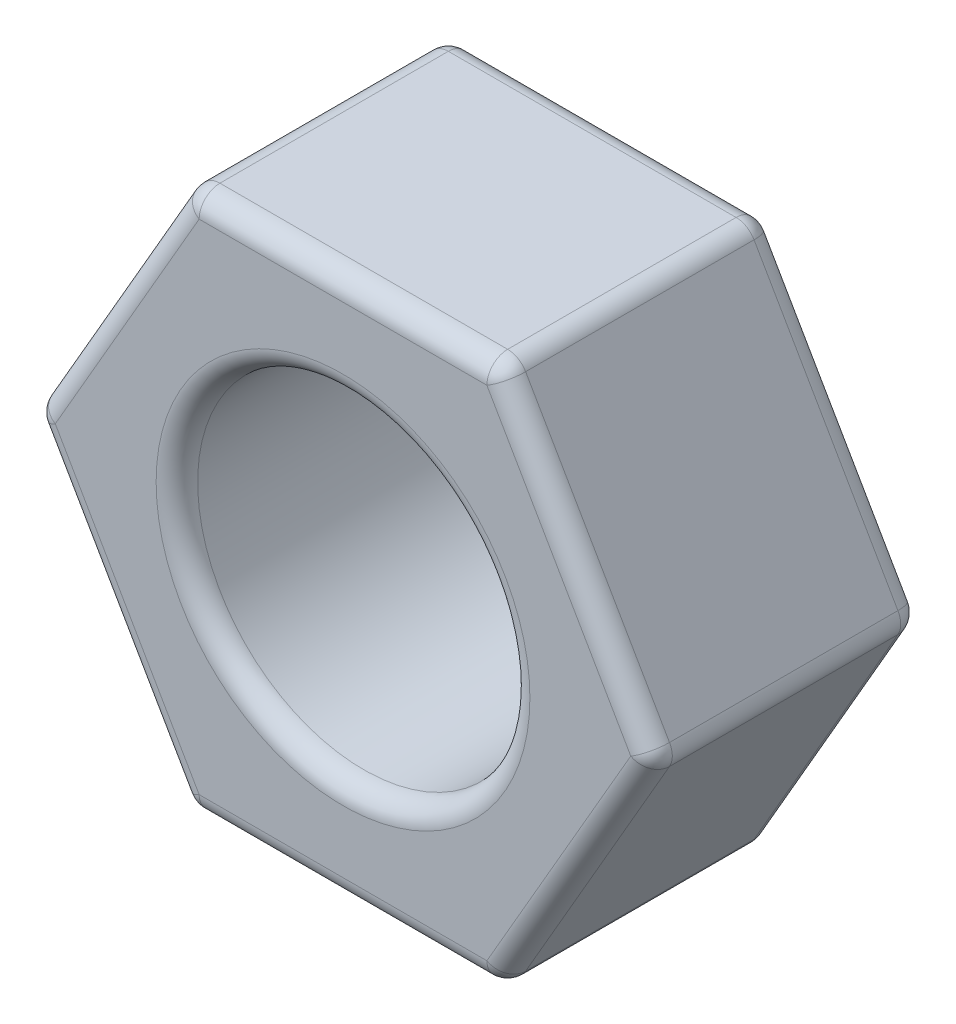
ISO-10303-21;
HEADER;
FILE_DESCRIPTION(('STEP AP214'),'2;1');
FILE_NAME('part.step','',(''),(''),'','','');
FILE_SCHEMA(('AUTOMOTIVE_DESIGN { 1 0 10303 214 1 1 1 1 }'));
ENDSEC;
DATA;
#1=APPLICATION_CONTEXT('core data for automotive mechanical design processes');
#2=APPLICATION_PROTOCOL_DEFINITION('international standard','automotive_design',2000,#1);
#3=PRODUCT_CONTEXT('',#1,'mechanical');
#4=PRODUCT('Part','Part','',(#3));
#5=PRODUCT_RELATED_PRODUCT_CATEGORY('part','',(#4));
#6=PRODUCT_DEFINITION_FORMATION('','',#4);
#7=PRODUCT_DEFINITION_CONTEXT('part definition',#1,'design');
#8=PRODUCT_DEFINITION('design','',#6,#7);
#9=PRODUCT_DEFINITION_SHAPE('','',#8);
#10=(LENGTH_UNIT() NAMED_UNIT(*) SI_UNIT(.MILLI.,.METRE.));
#11=(NAMED_UNIT(*) PLANE_ANGLE_UNIT() SI_UNIT($,.RADIAN.));
#12=(NAMED_UNIT(*) SI_UNIT($,.STERADIAN.) SOLID_ANGLE_UNIT());
#13=UNCERTAINTY_MEASURE_WITH_UNIT(LENGTH_MEASURE(1.E-05),#10,'distance_accuracy_value','');
#14=(GEOMETRIC_REPRESENTATION_CONTEXT(3) GLOBAL_UNCERTAINTY_ASSIGNED_CONTEXT((#13)) GLOBAL_UNIT_ASSIGNED_CONTEXT((#10,
#11,#12)) REPRESENTATION_CONTEXT('',''));
#15=CARTESIAN_POINT('',(0.,0.,0.));
#16=DIRECTION('',(0.,0.,1.));
#17=DIRECTION('',(1.,0.,0.));
#18=AXIS2_PLACEMENT_3D('',#15,#16,#17);
#19=CARTESIAN_POINT('',(-3.75277674973257,6.5,6.5));
#20=DIRECTION('',(0.866025403784439,-0.5,0.));
#21=DIRECTION('',(0.5,0.866025403784439,0.));
#22=AXIS2_PLACEMENT_3D('',#19,#20,#21);
#23=PLANE('',#22);
#24=DIRECTION('',(0.,0.,-1.));
#25=VECTOR('',#24,1.);
#26=CARTESIAN_POINT('',(-3.89711431702997,6.25,6.5));
#27=LINE('',#26,#25);
#28=CARTESIAN_POINT('',(-3.89711431702997,6.25,6.));
#29=VERTEX_POINT('',#28);
#30=CARTESIAN_POINT('',(-3.89711431702997,6.25,0.5));
#31=VERTEX_POINT('',#30);
#32=EDGE_CURVE('E255',#29,#31,#27,.T.);
#33=ORIENTED_EDGE('',*,*,#32,.T.);
#34=DIRECTION('',(-0.5,-0.866025403784439,0.));
#35=VECTOR('',#34,1.);
#36=CARTESIAN_POINT('',(-3.75277674973257,6.5,0.5));
#37=LINE('',#36,#35);
#38=CARTESIAN_POINT('',(-7.36121593216773,0.25,0.5));
#39=VERTEX_POINT('',#38);
#40=EDGE_CURVE('E260',#31,#39,#37,.T.);
#41=ORIENTED_EDGE('',*,*,#40,.T.);
#42=DIRECTION('',(0.,0.,-1.));
#43=VECTOR('',#42,1.);
#44=CARTESIAN_POINT('',(-7.36121593216773,0.249999999999999,6.5));
#45=LINE('',#44,#43);
#46=CARTESIAN_POINT('',(-7.36121593216773,0.25,6.));
#47=VERTEX_POINT('',#46);
#48=EDGE_CURVE('E257',#39,#47,#45,.F.);
#49=ORIENTED_EDGE('',*,*,#48,.T.);
#50=DIRECTION('',(-0.5,-0.866025403784439,0.));
#51=VECTOR('',#50,1.);
#52=CARTESIAN_POINT('',(-3.75277674973257,6.5,6.));
#53=LINE('',#52,#51);
#54=EDGE_CURVE('E253',#47,#29,#53,.F.);
#55=ORIENTED_EDGE('',*,*,#54,.T.);
#56=EDGE_LOOP('',(#33,#41,#49,#55));
#57=FACE_BOUND('',#56,.T.);
#58=ADVANCED_FACE('F35',(#57),#23,.F.);
#59=CARTESIAN_POINT('',(-7.50555349946513,0.,6.5));
#60=DIRECTION('',(0.866025403784439,0.5,0.));
#61=DIRECTION('',(-0.5,0.866025403784439,0.));
#62=AXIS2_PLACEMENT_3D('',#59,#60,#61);
#63=PLANE('',#62);
#64=DIRECTION('',(0.,0.,-1.));
#65=VECTOR('',#64,1.);
#66=CARTESIAN_POINT('',(-7.36121593216773,-0.250000000000001,6.5));
#67=LINE('',#66,#65);
#68=CARTESIAN_POINT('',(-7.36121593216773,-0.250000000000001,6.));
#69=VERTEX_POINT('',#68);
#70=CARTESIAN_POINT('',(-7.36121593216773,-0.250000000000001,0.5));
#71=VERTEX_POINT('',#70);
#72=EDGE_CURVE('E229',#69,#71,#67,.T.);
#73=ORIENTED_EDGE('',*,*,#72,.T.);
#74=DIRECTION('',(0.5,-0.866025403784439,0.));
#75=VECTOR('',#74,1.);
#76=CARTESIAN_POINT('',(-7.50555349946513,0.,0.5));
#77=LINE('',#76,#75);
#78=CARTESIAN_POINT('',(-3.89711431702997,-6.25,0.5));
#79=VERTEX_POINT('',#78);
#80=EDGE_CURVE('E234',#71,#79,#77,.T.);
#81=ORIENTED_EDGE('',*,*,#80,.T.);
#82=DIRECTION('',(0.,0.,-1.));
#83=VECTOR('',#82,1.);
#84=CARTESIAN_POINT('',(-3.89711431702997,-6.25,6.5));
#85=LINE('',#84,#83);
#86=CARTESIAN_POINT('',(-3.89711431702997,-6.25,6.));
#87=VERTEX_POINT('',#86);
#88=EDGE_CURVE('E231',#79,#87,#85,.F.);
#89=ORIENTED_EDGE('',*,*,#88,.T.);
#90=DIRECTION('',(0.5,-0.866025403784439,0.));
#91=VECTOR('',#90,1.);
#92=CARTESIAN_POINT('',(-7.50555349946513,0.,6.));
#93=LINE('',#92,#91);
#94=EDGE_CURVE('E227',#87,#69,#93,.F.);
#95=ORIENTED_EDGE('',*,*,#94,.T.);
#96=EDGE_LOOP('',(#73,#81,#89,#95));
#97=FACE_BOUND('',#96,.T.);
#98=ADVANCED_FACE('F418',(#97),#63,.F.);
#99=CARTESIAN_POINT('',(-3.75277674973257,-6.5,6.5));
#100=DIRECTION('',(0.,1.,0.));
#101=DIRECTION('',(0.,0.,1.));
#102=AXIS2_PLACEMENT_3D('',#99,#100,#101);
#103=PLANE('',#102);
#104=DIRECTION('',(0.,0.,-1.));
#105=VECTOR('',#104,1.);
#106=CARTESIAN_POINT('',(-3.46410161513775,-6.5,6.5));
#107=LINE('',#106,#105);
#108=CARTESIAN_POINT('',(-3.46410161513775,-6.5,6.));
#109=VERTEX_POINT('',#108);
#110=CARTESIAN_POINT('',(-3.46410161513775,-6.5,0.5));
#111=VERTEX_POINT('',#110);
#112=EDGE_CURVE('E222',#109,#111,#107,.T.);
#113=ORIENTED_EDGE('',*,*,#112,.T.);
#114=DIRECTION('',(1.,0.,0.));
#115=VECTOR('',#114,1.);
#116=CARTESIAN_POINT('',(-3.75277674973257,-6.5,0.5));
#117=LINE('',#116,#115);
#118=CARTESIAN_POINT('',(3.46410161513775,-6.5,0.5));
#119=VERTEX_POINT('',#118);
#120=EDGE_CURVE('E225',#111,#119,#117,.T.);
#121=ORIENTED_EDGE('',*,*,#120,.T.);
#122=DIRECTION('',(0.,0.,-1.));
#123=VECTOR('',#122,1.);
#124=CARTESIAN_POINT('',(3.46410161513775,-6.5,6.5));
#125=LINE('',#124,#123);
#126=CARTESIAN_POINT('',(3.46410161513775,-6.5,6.));
#127=VERTEX_POINT('',#126);
#128=EDGE_CURVE('E220',#119,#127,#125,.F.);
#129=ORIENTED_EDGE('',*,*,#128,.T.);
#130=DIRECTION('',(1.,0.,0.));
#131=VECTOR('',#130,1.);
#132=CARTESIAN_POINT('',(-3.75277674973257,-6.5,6.));
#133=LINE('',#132,#131);
#134=EDGE_CURVE('E218',#127,#109,#133,.F.);
#135=ORIENTED_EDGE('',*,*,#134,.T.);
#136=EDGE_LOOP('',(#113,#121,#129,#135));
#137=FACE_BOUND('',#136,.T.);
#138=ADVANCED_FACE('F384',(#137),#103,.F.);
#139=CARTESIAN_POINT('',(3.75277674973257,-6.5,6.5));
#140=DIRECTION('',(-0.866025403784439,0.5,0.));
#141=DIRECTION('',(-0.5,-0.866025403784439,0.));
#142=AXIS2_PLACEMENT_3D('',#139,#140,#141);
#143=PLANE('',#142);
#144=DIRECTION('',(0.,0.,-1.));
#145=VECTOR('',#144,1.);
#146=CARTESIAN_POINT('',(3.89711431702997,-6.25,6.5));
#147=LINE('',#146,#145);
#148=CARTESIAN_POINT('',(3.89711431702997,-6.25,6.));
#149=VERTEX_POINT('',#148);
#150=CARTESIAN_POINT('',(3.89711431702997,-6.25,0.5));
#151=VERTEX_POINT('',#150);
#152=EDGE_CURVE('E240',#149,#151,#147,.T.);
#153=ORIENTED_EDGE('',*,*,#152,.T.);
#154=DIRECTION('',(0.5,0.866025403784439,0.));
#155=VECTOR('',#154,1.);
#156=CARTESIAN_POINT('',(3.75277674973257,-6.5,0.5));
#157=LINE('',#156,#155);
#158=CARTESIAN_POINT('',(7.36121593216773,-0.249999999999998,0.5));
#159=VERTEX_POINT('',#158);
#160=EDGE_CURVE('E243',#151,#159,#157,.T.);
#161=ORIENTED_EDGE('',*,*,#160,.T.);
#162=DIRECTION('',(0.,0.,-1.));
#163=VECTOR('',#162,1.);
#164=CARTESIAN_POINT('',(7.36121593216773,-0.249999999999997,6.5));
#165=LINE('',#164,#163);
#166=CARTESIAN_POINT('',(7.36121593216773,-0.249999999999998,6.));
#167=VERTEX_POINT('',#166);
#168=EDGE_CURVE('E238',#159,#167,#165,.F.);
#169=ORIENTED_EDGE('',*,*,#168,.T.);
#170=DIRECTION('',(0.5,0.866025403784439,0.));
#171=VECTOR('',#170,1.);
#172=CARTESIAN_POINT('',(3.75277674973257,-6.5,6.));
#173=LINE('',#172,#171);
#174=EDGE_CURVE('E236',#167,#149,#173,.F.);
#175=ORIENTED_EDGE('',*,*,#174,.T.);
#176=EDGE_LOOP('',(#153,#161,#169,#175));
#177=FACE_BOUND('',#176,.T.);
#178=ADVANCED_FACE('F394',(#177),#143,.F.);
#179=CARTESIAN_POINT('',(7.50555349946513,0.,6.5));
#180=DIRECTION('',(-0.866025403784438,-0.5,0.));
#181=DIRECTION('',(0.5,-0.866025403784439,0.));
#182=AXIS2_PLACEMENT_3D('',#179,#180,#181);
#183=PLANE('',#182);
#184=DIRECTION('',(0.,0.,-1.));
#185=VECTOR('',#184,1.);
#186=CARTESIAN_POINT('',(7.36121593216773,0.250000000000002,6.5));
#187=LINE('',#186,#185);
#188=CARTESIAN_POINT('',(7.36121593216773,0.250000000000002,6.));
#189=VERTEX_POINT('',#188);
#190=CARTESIAN_POINT('',(7.36121593216773,0.250000000000002,0.5));
#191=VERTEX_POINT('',#190);
#192=EDGE_CURVE('E248',#189,#191,#187,.T.);
#193=ORIENTED_EDGE('',*,*,#192,.T.);
#194=DIRECTION('',(-0.5,0.866025403784439,0.));
#195=VECTOR('',#194,1.);
#196=CARTESIAN_POINT('',(7.50555349946513,0.,0.5));
#197=LINE('',#196,#195);
#198=CARTESIAN_POINT('',(3.89711431702997,6.25,0.5));
#199=VERTEX_POINT('',#198);
#200=EDGE_CURVE('E251',#191,#199,#197,.T.);
#201=ORIENTED_EDGE('',*,*,#200,.T.);
#202=DIRECTION('',(0.,0.,-1.));
#203=VECTOR('',#202,1.);
#204=CARTESIAN_POINT('',(3.89711431702997,6.25,6.5));
#205=LINE('',#204,#203);
#206=CARTESIAN_POINT('',(3.89711431702997,6.25,6.));
#207=VERTEX_POINT('',#206);
#208=EDGE_CURVE('E246',#199,#207,#205,.F.);
#209=ORIENTED_EDGE('',*,*,#208,.T.);
#210=DIRECTION('',(-0.5,0.866025403784439,0.));
#211=VECTOR('',#210,1.);
#212=CARTESIAN_POINT('',(7.50555349946513,0.,6.));
#213=LINE('',#212,#211);
#214=EDGE_CURVE('E188',#207,#189,#213,.F.);
#215=ORIENTED_EDGE('',*,*,#214,.T.);
#216=EDGE_LOOP('',(#193,#201,#209,#215));
#217=FACE_BOUND('',#216,.T.);
#218=ADVANCED_FACE('F542',(#217),#183,.F.);
#219=CARTESIAN_POINT('',(3.75277674973257,6.5,6.5));
#220=DIRECTION('',(0.,-1.,0.));
#221=DIRECTION('',(0.,0.,-1.));
#222=AXIS2_PLACEMENT_3D('',#219,#220,#221);
#223=PLANE('',#222);
#224=DIRECTION('',(0.,0.,-1.));
#225=VECTOR('',#224,1.);
#226=CARTESIAN_POINT('',(3.46410161513775,6.5,6.5));
#227=LINE('',#226,#225);
#228=CARTESIAN_POINT('',(3.46410161513775,6.5,6.));
#229=VERTEX_POINT('',#228);
#230=CARTESIAN_POINT('',(3.46410161513775,6.5,0.5));
#231=VERTEX_POINT('',#230);
#232=EDGE_CURVE('E55',#229,#231,#227,.T.);
#233=ORIENTED_EDGE('',*,*,#232,.T.);
#234=DIRECTION('',(-1.,0.,0.));
#235=VECTOR('',#234,1.);
#236=CARTESIAN_POINT('',(3.75277674973257,6.5,0.5));
#237=LINE('',#236,#235);
#238=CARTESIAN_POINT('',(-3.46410161513775,6.5,0.5));
#239=VERTEX_POINT('',#238);
#240=EDGE_CURVE('E11',#231,#239,#237,.T.);
#241=ORIENTED_EDGE('',*,*,#240,.T.);
#242=DIRECTION('',(0.,0.,-1.));
#243=VECTOR('',#242,1.);
#244=CARTESIAN_POINT('',(-3.46410161513775,6.5,6.5));
#245=LINE('',#244,#243);
#246=CARTESIAN_POINT('',(-3.46410161513775,6.5,6.));
#247=VERTEX_POINT('',#246);
#248=EDGE_CURVE('E44',#239,#247,#245,.F.);
#249=ORIENTED_EDGE('',*,*,#248,.T.);
#250=DIRECTION('',(-1.,0.,0.));
#251=VECTOR('',#250,1.);
#252=CARTESIAN_POINT('',(3.75277674973257,6.5,6.));
#253=LINE('',#252,#251);
#254=EDGE_CURVE('E262',#247,#229,#253,.F.);
#255=ORIENTED_EDGE('',*,*,#254,.T.);
#256=EDGE_LOOP('',(#233,#241,#249,#255));
#257=FACE_BOUND('',#256,.T.);
#258=ADVANCED_FACE('F763',(#257),#223,.F.);
#259=CARTESIAN_POINT('',(0.,0.,6.5));
#260=DIRECTION('',(0.,0.,1.));
#261=DIRECTION('',(1.,0.,0.));
#262=AXIS2_PLACEMENT_3D('',#259,#260,#261);
#263=PLANE('',#262);
#264=CARTESIAN_POINT('',(0.,0.,6.5));
#265=DIRECTION('',(0.,0.,1.));
#266=DIRECTION('',(1.,0.,0.));
#267=AXIS2_PLACEMENT_3D('',#264,#265,#266);
#268=CIRCLE('',#267,4.5);
#269=CARTESIAN_POINT('',(4.5,0.,6.5));
#270=VERTEX_POINT('',#269);
#271=EDGE_CURVE('E194',#270,#270,#268,.F.);
#272=ORIENTED_EDGE('',*,*,#271,.T.);
#273=EDGE_LOOP('',(#272));
#274=FACE_BOUND('',#273,.T.);
#275=DIRECTION('',(0.5,0.866025403784439,0.));
#276=VECTOR('',#275,1.);
#277=CARTESIAN_POINT('',(7.07254079757291,0.250000000000002,6.5));
#278=LINE('',#277,#276);
#279=CARTESIAN_POINT('',(3.46410161513776,-6.,6.5));
#280=VERTEX_POINT('',#279);
#281=CARTESIAN_POINT('',(6.92820323027551,0.,6.5));
#282=VERTEX_POINT('',#281);
#283=EDGE_CURVE('E193',#280,#282,#278,.T.);
#284=ORIENTED_EDGE('',*,*,#283,.T.);
#285=DIRECTION('',(-0.5,0.866025403784439,0.));
#286=VECTOR('',#285,1.);
#287=CARTESIAN_POINT('',(3.31976404784034,6.25,6.5));
#288=LINE('',#287,#286);
#289=CARTESIAN_POINT('',(3.46410161513775,6.,6.5));
#290=VERTEX_POINT('',#289);
#291=EDGE_CURVE('E186',#282,#290,#288,.T.);
#292=ORIENTED_EDGE('',*,*,#291,.T.);
#293=DIRECTION('',(-1.,0.,0.));
#294=VECTOR('',#293,1.);
#295=CARTESIAN_POINT('',(-3.75277674973257,6.,6.5));
#296=LINE('',#295,#294);
#297=CARTESIAN_POINT('',(-3.46410161513775,6.,6.5));
#298=VERTEX_POINT('',#297);
#299=EDGE_CURVE('E160',#290,#298,#296,.T.);
#300=ORIENTED_EDGE('',*,*,#299,.T.);
#301=DIRECTION('',(-0.5,-0.866025403784439,0.));
#302=VECTOR('',#301,1.);
#303=CARTESIAN_POINT('',(-7.07254079757292,-0.250000000000001,6.5));
#304=LINE('',#303,#302);
#305=CARTESIAN_POINT('',(-6.92820323027551,0.,6.5));
#306=VERTEX_POINT('',#305);
#307=EDGE_CURVE('E169',#298,#306,#304,.T.);
#308=ORIENTED_EDGE('',*,*,#307,.T.);
#309=DIRECTION('',(0.5,-0.866025403784439,0.));
#310=VECTOR('',#309,1.);
#311=CARTESIAN_POINT('',(-3.31976404784035,-6.25,6.5));
#312=LINE('',#311,#310);
#313=CARTESIAN_POINT('',(-3.46410161513775,-6.,6.5));
#314=VERTEX_POINT('',#313);
#315=EDGE_CURVE('E365',#306,#314,#312,.T.);
#316=ORIENTED_EDGE('',*,*,#315,.T.);
#317=DIRECTION('',(1.,0.,0.));
#318=VECTOR('',#317,1.);
#319=CARTESIAN_POINT('',(3.75277674973257,-6.,6.5));
#320=LINE('',#319,#318);
#321=EDGE_CURVE('E199',#314,#280,#320,.T.);
#322=ORIENTED_EDGE('',*,*,#321,.T.);
#323=EDGE_LOOP('',(#284,#292,#300,#308,#316,#322));
#324=FACE_BOUND('',#323,.T.);
#325=ADVANCED_FACE('F191',(#274,#324),#263,.T.);
#326=CARTESIAN_POINT('',(0.,0.,0.));
#327=DIRECTION('',(0.,0.,1.));
#328=DIRECTION('',(1.,0.,0.));
#329=AXIS2_PLACEMENT_3D('',#326,#327,#328);
#330=PLANE('',#329);
#331=CARTESIAN_POINT('',(0.,0.,0.));
#332=DIRECTION('',(0.,0.,1.));
#333=DIRECTION('',(1.,0.,0.));
#334=AXIS2_PLACEMENT_3D('',#331,#332,#333);
#335=CIRCLE('',#334,4.5);
#336=CARTESIAN_POINT('',(4.5,0.,0.));
#337=VERTEX_POINT('',#336);
#338=EDGE_CURVE('E215',#337,#337,#335,.T.);
#339=ORIENTED_EDGE('',*,*,#338,.T.);
#340=EDGE_LOOP('',(#339));
#341=FACE_BOUND('',#340,.T.);
#342=DIRECTION('',(-1.,0.,0.));
#343=VECTOR('',#342,1.);
#344=CARTESIAN_POINT('',(0.,6.,0.));
#345=LINE('',#344,#343);
#346=CARTESIAN_POINT('',(-3.46410161513775,6.,0.));
#347=VERTEX_POINT('',#346);
#348=CARTESIAN_POINT('',(3.46410161513775,6.,0.));
#349=VERTEX_POINT('',#348);
#350=EDGE_CURVE('E197',#347,#349,#345,.F.);
#351=ORIENTED_EDGE('',*,*,#350,.T.);
#352=DIRECTION('',(-0.5,0.866025403784439,0.));
#353=VECTOR('',#352,1.);
#354=CARTESIAN_POINT('',(5.19615242270663,3.,0.));
#355=LINE('',#354,#353);
#356=CARTESIAN_POINT('',(6.92820323027551,0.,0.));
#357=VERTEX_POINT('',#356);
#358=EDGE_CURVE('E212',#349,#357,#355,.F.);
#359=ORIENTED_EDGE('',*,*,#358,.T.);
#360=DIRECTION('',(0.5,0.866025403784439,0.));
#361=VECTOR('',#360,1.);
#362=CARTESIAN_POINT('',(5.19615242270663,-3.,0.));
#363=LINE('',#362,#361);
#364=CARTESIAN_POINT('',(3.46410161513775,-6.,0.));
#365=VERTEX_POINT('',#364);
#366=EDGE_CURVE('E210',#357,#365,#363,.F.);
#367=ORIENTED_EDGE('',*,*,#366,.T.);
#368=DIRECTION('',(1.,0.,0.));
#369=VECTOR('',#368,1.);
#370=CARTESIAN_POINT('',(0.,-6.,0.));
#371=LINE('',#370,#369);
#372=CARTESIAN_POINT('',(-3.46410161513775,-6.,0.));
#373=VERTEX_POINT('',#372);
#374=EDGE_CURVE('E208',#365,#373,#371,.F.);
#375=ORIENTED_EDGE('',*,*,#374,.T.);
#376=DIRECTION('',(0.5,-0.866025403784439,0.));
#377=VECTOR('',#376,1.);
#378=CARTESIAN_POINT('',(-5.19615242270663,-3.,0.));
#379=LINE('',#378,#377);
#380=CARTESIAN_POINT('',(-6.92820323027551,0.,0.));
#381=VERTEX_POINT('',#380);
#382=EDGE_CURVE('E206',#373,#381,#379,.F.);
#383=ORIENTED_EDGE('',*,*,#382,.T.);
#384=DIRECTION('',(-0.5,-0.866025403784439,0.));
#385=VECTOR('',#384,1.);
#386=CARTESIAN_POINT('',(-5.19615242270663,3.,0.));
#387=LINE('',#386,#385);
#388=EDGE_CURVE('E204',#381,#347,#387,.F.);
#389=ORIENTED_EDGE('',*,*,#388,.T.);
#390=EDGE_LOOP('',(#351,#359,#367,#375,#383,#389));
#391=FACE_BOUND('',#390,.T.);
#392=ADVANCED_FACE('F512',(#341,#391),#330,.F.);
#393=CARTESIAN_POINT('',(0.,0.,6.5));
#394=DIRECTION('',(0.,0.,1.));
#395=DIRECTION('',(1.,0.,0.));
#396=AXIS2_PLACEMENT_3D('',#393,#394,#395);
#397=CYLINDRICAL_SURFACE('',#396,4.);
#398=CARTESIAN_POINT('',(0.,0.,6.));
#399=DIRECTION('',(0.,0.,1.));
#400=DIRECTION('',(1.,0.,0.));
#401=AXIS2_PLACEMENT_3D('',#398,#399,#400);
#402=CIRCLE('',#401,4.);
#403=CARTESIAN_POINT('',(4.,0.,6.));
#404=VERTEX_POINT('',#403);
#405=EDGE_CURVE('E170',#404,#404,#402,.T.);
#406=ORIENTED_EDGE('',*,*,#405,.T.);
#407=EDGE_LOOP('',(#406));
#408=FACE_BOUND('',#407,.T.);
#409=CARTESIAN_POINT('',(0.,0.,0.5));
#410=DIRECTION('',(0.,0.,1.));
#411=DIRECTION('',(1.,0.,0.));
#412=AXIS2_PLACEMENT_3D('',#409,#410,#411);
#413=CIRCLE('',#412,4.);
#414=CARTESIAN_POINT('',(4.,0.,0.5));
#415=VERTEX_POINT('',#414);
#416=EDGE_CURVE('E356',#415,#415,#413,.F.);
#417=ORIENTED_EDGE('',*,*,#416,.T.);
#418=EDGE_LOOP('',(#417));
#419=FACE_BOUND('',#418,.T.);
#420=ADVANCED_FACE('F432',(#408,#419),#397,.F.);
#421=CARTESIAN_POINT('',(0.,0.,6.));
#422=DIRECTION('',(0.,0.,1.));
#423=DIRECTION('',(1.,0.,0.));
#424=AXIS2_PLACEMENT_3D('',#421,#422,#423);
#425=TOROIDAL_SURFACE('',#424,4.5,0.5);
#426=ORIENTED_EDGE('',*,*,#271,.F.);
#427=EDGE_LOOP('',(#426));
#428=FACE_BOUND('',#427,.T.);
#429=ORIENTED_EDGE('',*,*,#405,.F.);
#430=EDGE_LOOP('',(#429));
#431=FACE_BOUND('',#430,.T.);
#432=ADVANCED_FACE('F428',(#428,#431),#425,.T.);
#433=CARTESIAN_POINT('',(0.,0.,0.5));
#434=DIRECTION('',(0.,0.,1.));
#435=DIRECTION('',(1.,0.,0.));
#436=AXIS2_PLACEMENT_3D('',#433,#434,#435);
#437=TOROIDAL_SURFACE('',#436,4.5,0.5);
#438=ORIENTED_EDGE('',*,*,#416,.F.);
#439=EDGE_LOOP('',(#438));
#440=FACE_BOUND('',#439,.T.);
#441=ORIENTED_EDGE('',*,*,#338,.F.);
#442=EDGE_LOOP('',(#441));
#443=FACE_BOUND('',#442,.T.);
#444=ADVANCED_FACE('F431',(#440,#443),#437,.T.);
#445=CARTESIAN_POINT('',(3.46410161513775,6.,6.5));
#446=DIRECTION('',(0.,0.,-1.));
#447=DIRECTION('',(-1.,0.,0.));
#448=AXIS2_PLACEMENT_3D('',#445,#446,#447);
#449=CYLINDRICAL_SURFACE('',#448,0.5);
#450=CARTESIAN_POINT('',(3.46410161513775,6.,6.));
#451=DIRECTION('',(0.,0.,1.));
#452=DIRECTION('',(1.,0.,0.));
#453=AXIS2_PLACEMENT_3D('',#450,#451,#452);
#454=CIRCLE('',#453,0.5);
#455=EDGE_CURVE('E39',#207,#229,#454,.T.);
#456=ORIENTED_EDGE('',*,*,#455,.F.);
#457=ORIENTED_EDGE('',*,*,#208,.F.);
#458=CARTESIAN_POINT('',(3.46410161513775,6.,0.5));
#459=DIRECTION('',(0.,0.,-1.));
#460=DIRECTION('',(-1.,0.,0.));
#461=AXIS2_PLACEMENT_3D('',#458,#459,#460);
#462=CIRCLE('',#461,0.5);
#463=EDGE_CURVE('E180',#231,#199,#462,.T.);
#464=ORIENTED_EDGE('',*,*,#463,.F.);
#465=ORIENTED_EDGE('',*,*,#232,.F.);
#466=EDGE_LOOP('',(#456,#457,#464,#465));
#467=FACE_BOUND('',#466,.T.);
#468=ADVANCED_FACE('F37',(#467),#449,.T.);
#469=CARTESIAN_POINT('',(3.46410161513775,6.,6.));
#470=DIRECTION('',(0.,0.,1.));
#471=DIRECTION('',(1.,0.,0.));
#472=AXIS2_PLACEMENT_3D('',#469,#470,#471);
#473=SPHERICAL_SURFACE('',#472,0.5);
#474=CARTESIAN_POINT('',(3.46410161513775,6.,6.));
#475=DIRECTION('',(-0.499999999999999,0.86602540378444,0.));
#476=DIRECTION('',(-0.86602540378444,-0.499999999999999,0.));
#477=AXIS2_PLACEMENT_3D('',#474,#475,#476);
#478=CIRCLE('',#477,0.5);
#479=EDGE_CURVE('E177',#207,#290,#478,.F.);
#480=ORIENTED_EDGE('',*,*,#479,.F.);
#481=ORIENTED_EDGE('',*,*,#455,.T.);
#482=CARTESIAN_POINT('',(3.46410161513775,6.,6.));
#483=DIRECTION('',(1.,0.,0.));
#484=DIRECTION('',(0.,0.,-1.));
#485=AXIS2_PLACEMENT_3D('',#482,#483,#484);
#486=CIRCLE('',#485,0.5);
#487=EDGE_CURVE('E164',#290,#229,#486,.F.);
#488=ORIENTED_EDGE('',*,*,#487,.F.);
#489=EDGE_LOOP('',(#480,#481,#488));
#490=FACE_BOUND('',#489,.T.);
#491=ADVANCED_FACE('F176',(#490),#473,.T.);
#492=CARTESIAN_POINT('',(3.46410161513775,6.,0.5));
#493=DIRECTION('',(0.,0.,1.));
#494=DIRECTION('',(1.,0.,0.));
#495=AXIS2_PLACEMENT_3D('',#492,#493,#494);
#496=SPHERICAL_SURFACE('',#495,0.5);
#497=CARTESIAN_POINT('',(3.46410161513775,6.,0.5));
#498=DIRECTION('',(1.,0.,0.));
#499=DIRECTION('',(0.,1.,0.));
#500=AXIS2_PLACEMENT_3D('',#497,#498,#499);
#501=CIRCLE('',#500,0.5);
#502=EDGE_CURVE('E348',#231,#349,#501,.F.);
#503=ORIENTED_EDGE('',*,*,#502,.F.);
#504=ORIENTED_EDGE('',*,*,#463,.T.);
#505=CARTESIAN_POINT('',(3.46410161513775,6.,0.5));
#506=DIRECTION('',(-0.5,0.866025403784438,0.));
#507=DIRECTION('',(-0.866025403784438,-0.5,0.));
#508=AXIS2_PLACEMENT_3D('',#505,#506,#507);
#509=CIRCLE('',#508,0.5);
#510=EDGE_CURVE('E189',#349,#199,#509,.F.);
#511=ORIENTED_EDGE('',*,*,#510,.F.);
#512=EDGE_LOOP('',(#503,#504,#511));
#513=FACE_BOUND('',#512,.T.);
#514=ADVANCED_FACE('F544',(#513),#496,.T.);
#515=CARTESIAN_POINT('',(0.,6.,6.));
#516=DIRECTION('',(1.,0.,0.));
#517=DIRECTION('',(0.,0.,-1.));
#518=AXIS2_PLACEMENT_3D('',#515,#516,#517);
#519=CYLINDRICAL_SURFACE('',#518,0.5);
#520=ORIENTED_EDGE('',*,*,#487,.T.);
#521=ORIENTED_EDGE('',*,*,#254,.F.);
#522=CARTESIAN_POINT('',(-3.46410161513775,6.,6.));
#523=DIRECTION('',(-1.,0.,0.));
#524=DIRECTION('',(0.,-1.,0.));
#525=AXIS2_PLACEMENT_3D('',#522,#523,#524);
#526=CIRCLE('',#525,0.5);
#527=EDGE_CURVE('E165',#298,#247,#526,.T.);
#528=ORIENTED_EDGE('',*,*,#527,.F.);
#529=ORIENTED_EDGE('',*,*,#299,.F.);
#530=EDGE_LOOP('',(#520,#521,#528,#529));
#531=FACE_BOUND('',#530,.T.);
#532=ADVANCED_FACE('F162',(#531),#519,.T.);
#533=CARTESIAN_POINT('',(5.19615242270663,3.,6.));
#534=DIRECTION('',(0.5,-0.866025403784439,0.));
#535=DIRECTION('',(0.866025403784438,0.5,0.));
#536=AXIS2_PLACEMENT_3D('',#533,#534,#535);
#537=CYLINDRICAL_SURFACE('',#536,0.5);
#538=ORIENTED_EDGE('',*,*,#479,.T.);
#539=ORIENTED_EDGE('',*,*,#291,.F.);
#540=CARTESIAN_POINT('',(6.92820323027551,0.,6.));
#541=DIRECTION('',(0.5,-0.866025403784439,0.));
#542=DIRECTION('',(0.866025403784439,0.5,0.));
#543=AXIS2_PLACEMENT_3D('',#540,#541,#542);
#544=CIRCLE('',#543,0.5);
#545=EDGE_CURVE('E342',#189,#282,#544,.T.);
#546=ORIENTED_EDGE('',*,*,#545,.F.);
#547=ORIENTED_EDGE('',*,*,#214,.F.);
#548=EDGE_LOOP('',(#538,#539,#546,#547));
#549=FACE_BOUND('',#548,.T.);
#550=ADVANCED_FACE('F184',(#549),#537,.T.);
#551=CARTESIAN_POINT('',(6.92820323027551,0.,6.5));
#552=DIRECTION('',(0.,0.,-1.));
#553=DIRECTION('',(-1.,0.,0.));
#554=AXIS2_PLACEMENT_3D('',#551,#552,#553);
#555=CYLINDRICAL_SURFACE('',#554,0.5);
#556=CARTESIAN_POINT('',(6.92820323027551,0.,0.5));
#557=DIRECTION('',(0.,0.,-1.));
#558=DIRECTION('',(-1.,0.,0.));
#559=AXIS2_PLACEMENT_3D('',#556,#557,#558);
#560=CIRCLE('',#559,0.5);
#561=EDGE_CURVE('E336',#191,#159,#560,.T.);
#562=ORIENTED_EDGE('',*,*,#561,.F.);
#563=ORIENTED_EDGE('',*,*,#192,.F.);
#564=CARTESIAN_POINT('',(6.92820323027551,0.,6.));
#565=DIRECTION('',(0.,0.,1.));
#566=DIRECTION('',(1.,0.,0.));
#567=AXIS2_PLACEMENT_3D('',#564,#565,#566);
#568=CIRCLE('',#567,0.5);
#569=EDGE_CURVE('E339',#167,#189,#568,.T.);
#570=ORIENTED_EDGE('',*,*,#569,.F.);
#571=ORIENTED_EDGE('',*,*,#168,.F.);
#572=EDGE_LOOP('',(#562,#563,#570,#571));
#573=FACE_BOUND('',#572,.T.);
#574=ADVANCED_FACE('F400',(#573),#555,.T.);
#575=CARTESIAN_POINT('',(7.07254079757291,-0.249999999999998,0.5));
#576=DIRECTION('',(-0.5,0.866025403784439,0.));
#577=DIRECTION('',(-0.866025403784438,-0.5,0.));
#578=AXIS2_PLACEMENT_3D('',#575,#576,#577);
#579=CYLINDRICAL_SURFACE('',#578,0.5);
#580=ORIENTED_EDGE('',*,*,#510,.T.);
#581=ORIENTED_EDGE('',*,*,#200,.F.);
#582=CARTESIAN_POINT('',(6.92820323027551,0.,0.5));
#583=DIRECTION('',(0.5,-0.866025403784439,0.));
#584=DIRECTION('',(0.866025403784439,0.5,0.));
#585=AXIS2_PLACEMENT_3D('',#582,#583,#584);
#586=CIRCLE('',#585,0.5);
#587=EDGE_CURVE('E334',#357,#191,#586,.T.);
#588=ORIENTED_EDGE('',*,*,#587,.F.);
#589=ORIENTED_EDGE('',*,*,#358,.F.);
#590=EDGE_LOOP('',(#580,#581,#588,#589));
#591=FACE_BOUND('',#590,.T.);
#592=ADVANCED_FACE('F539',(#591),#579,.T.);
#593=CARTESIAN_POINT('',(3.75277674973257,6.,0.5));
#594=DIRECTION('',(-1.,0.,0.));
#595=DIRECTION('',(0.,0.,1.));
#596=AXIS2_PLACEMENT_3D('',#593,#594,#595);
#597=CYLINDRICAL_SURFACE('',#596,0.5);
#598=ORIENTED_EDGE('',*,*,#502,.T.);
#599=ORIENTED_EDGE('',*,*,#350,.F.);
#600=CARTESIAN_POINT('',(-3.46410161513775,6.,0.5));
#601=DIRECTION('',(-1.,0.,0.));
#602=DIRECTION('',(0.,0.,1.));
#603=AXIS2_PLACEMENT_3D('',#600,#601,#602);
#604=CIRCLE('',#603,0.5);
#605=EDGE_CURVE('E331',#239,#347,#604,.T.);
#606=ORIENTED_EDGE('',*,*,#605,.F.);
#607=ORIENTED_EDGE('',*,*,#240,.F.);
#608=EDGE_LOOP('',(#598,#599,#606,#607));
#609=FACE_BOUND('',#608,.T.);
#610=ADVANCED_FACE('F510',(#609),#597,.T.);
#611=CARTESIAN_POINT('',(-3.46410161513775,6.,6.5));
#612=DIRECTION('',(0.,0.,-1.));
#613=DIRECTION('',(-1.,0.,0.));
#614=AXIS2_PLACEMENT_3D('',#611,#612,#613);
#615=CYLINDRICAL_SURFACE('',#614,0.5);
#616=CARTESIAN_POINT('',(-3.46410161513775,6.,6.));
#617=DIRECTION('',(0.,0.,1.));
#618=DIRECTION('',(1.,0.,0.));
#619=AXIS2_PLACEMENT_3D('',#616,#617,#618);
#620=CIRCLE('',#619,0.5);
#621=EDGE_CURVE('E345',#247,#29,#620,.T.);
#622=ORIENTED_EDGE('',*,*,#621,.F.);
#623=ORIENTED_EDGE('',*,*,#248,.F.);
#624=CARTESIAN_POINT('',(-3.46410161513775,6.,0.5));
#625=DIRECTION('',(0.,0.,-1.));
#626=DIRECTION('',(-1.,0.,0.));
#627=AXIS2_PLACEMENT_3D('',#624,#625,#626);
#628=CIRCLE('',#627,0.5);
#629=EDGE_CURVE('E328',#31,#239,#628,.T.);
#630=ORIENTED_EDGE('',*,*,#629,.F.);
#631=ORIENTED_EDGE('',*,*,#32,.F.);
#632=EDGE_LOOP('',(#622,#623,#630,#631));
#633=FACE_BOUND('',#632,.T.);
#634=ADVANCED_FACE('F414',(#633),#615,.T.);
#635=CARTESIAN_POINT('',(-3.46410161513775,6.,6.));
#636=DIRECTION('',(0.,0.,1.));
#637=DIRECTION('',(1.,0.,0.));
#638=AXIS2_PLACEMENT_3D('',#635,#636,#637);
#639=SPHERICAL_SURFACE('',#638,0.5);
#640=ORIENTED_EDGE('',*,*,#527,.T.);
#641=ORIENTED_EDGE('',*,*,#621,.T.);
#642=CARTESIAN_POINT('',(-3.46410161513775,6.,6.));
#643=DIRECTION('',(0.5,0.866025403784438,0.));
#644=DIRECTION('',(-0.866025403784438,0.5,0.));
#645=AXIS2_PLACEMENT_3D('',#642,#643,#644);
#646=CIRCLE('',#645,0.5);
#647=EDGE_CURVE('E325',#298,#29,#646,.F.);
#648=ORIENTED_EDGE('',*,*,#647,.F.);
#649=EDGE_LOOP('',(#640,#641,#648));
#650=FACE_BOUND('',#649,.T.);
#651=ADVANCED_FACE('F405',(#650),#639,.T.);
#652=CARTESIAN_POINT('',(6.92820323027551,0.,6.));
#653=DIRECTION('',(0.,0.,1.));
#654=DIRECTION('',(1.,0.,0.));
#655=AXIS2_PLACEMENT_3D('',#652,#653,#654);
#656=SPHERICAL_SURFACE('',#655,0.5);
#657=ORIENTED_EDGE('',*,*,#569,.T.);
#658=ORIENTED_EDGE('',*,*,#545,.T.);
#659=CARTESIAN_POINT('',(6.92820323027551,0.,6.));
#660=DIRECTION('',(0.499999999999997,0.86602540378444,0.));
#661=DIRECTION('',(-0.86602540378444,0.499999999999998,0.));
#662=AXIS2_PLACEMENT_3D('',#659,#660,#661);
#663=CIRCLE('',#662,0.5);
#664=EDGE_CURVE('E322',#167,#282,#663,.F.);
#665=ORIENTED_EDGE('',*,*,#664,.F.);
#666=EDGE_LOOP('',(#657,#658,#665));
#667=FACE_BOUND('',#666,.T.);
#668=ADVANCED_FACE('F402',(#667),#656,.T.);
#669=CARTESIAN_POINT('',(6.92820323027551,0.,0.5));
#670=DIRECTION('',(0.,0.,1.));
#671=DIRECTION('',(1.,0.,0.));
#672=AXIS2_PLACEMENT_3D('',#669,#670,#671);
#673=SPHERICAL_SURFACE('',#672,0.5);
#674=ORIENTED_EDGE('',*,*,#587,.T.);
#675=ORIENTED_EDGE('',*,*,#561,.T.);
#676=CARTESIAN_POINT('',(6.92820323027551,0.,0.5));
#677=DIRECTION('',(0.499999999999999,0.866025403784439,0.));
#678=DIRECTION('',(-0.866025403784439,0.5,0.));
#679=AXIS2_PLACEMENT_3D('',#676,#677,#678);
#680=CIRCLE('',#679,0.5);
#681=EDGE_CURVE('E319',#357,#159,#680,.F.);
#682=ORIENTED_EDGE('',*,*,#681,.F.);
#683=EDGE_LOOP('',(#674,#675,#682));
#684=FACE_BOUND('',#683,.T.);
#685=ADVANCED_FACE('F404',(#684),#673,.T.);
#686=CARTESIAN_POINT('',(-3.46410161513775,6.,0.5));
#687=DIRECTION('',(0.,0.,1.));
#688=DIRECTION('',(1.,0.,0.));
#689=AXIS2_PLACEMENT_3D('',#686,#687,#688);
#690=SPHERICAL_SURFACE('',#689,0.5);
#691=ORIENTED_EDGE('',*,*,#629,.T.);
#692=ORIENTED_EDGE('',*,*,#605,.T.);
#693=CARTESIAN_POINT('',(-3.46410161513775,6.,0.5));
#694=DIRECTION('',(0.5,0.866025403784438,0.));
#695=DIRECTION('',(-0.866025403784438,0.5,0.));
#696=AXIS2_PLACEMENT_3D('',#693,#694,#695);
#697=CIRCLE('',#696,0.5);
#698=EDGE_CURVE('E316',#31,#347,#697,.F.);
#699=ORIENTED_EDGE('',*,*,#698,.F.);
#700=EDGE_LOOP('',(#691,#692,#699));
#701=FACE_BOUND('',#700,.T.);
#702=ADVANCED_FACE('F411',(#701),#690,.T.);
#703=CARTESIAN_POINT('',(-5.19615242270663,3.,6.));
#704=DIRECTION('',(0.5,0.866025403784439,0.));
#705=DIRECTION('',(-0.866025403784439,0.5,0.));
#706=AXIS2_PLACEMENT_3D('',#703,#704,#705);
#707=CYLINDRICAL_SURFACE('',#706,0.5);
#708=ORIENTED_EDGE('',*,*,#647,.T.);
#709=ORIENTED_EDGE('',*,*,#54,.F.);
#710=CARTESIAN_POINT('',(-6.92820323027551,0.,6.));
#711=DIRECTION('',(-0.500000000000002,-0.866025403784438,0.));
#712=DIRECTION('',(0.866025403784438,-0.500000000000002,0.));
#713=AXIS2_PLACEMENT_3D('',#710,#711,#712);
#714=CIRCLE('',#713,0.5);
#715=EDGE_CURVE('E311',#306,#47,#714,.T.);
#716=ORIENTED_EDGE('',*,*,#715,.F.);
#717=ORIENTED_EDGE('',*,*,#307,.F.);
#718=EDGE_LOOP('',(#708,#709,#716,#717));
#719=FACE_BOUND('',#718,.T.);
#720=ADVANCED_FACE('F493',(#719),#707,.T.);
#721=CARTESIAN_POINT('',(5.19615242270663,-3.,6.));
#722=DIRECTION('',(-0.5,-0.866025403784439,0.));
#723=DIRECTION('',(0.866025403784439,-0.5,0.));
#724=AXIS2_PLACEMENT_3D('',#721,#722,#723);
#725=CYLINDRICAL_SURFACE('',#724,0.5);
#726=ORIENTED_EDGE('',*,*,#664,.T.);
#727=ORIENTED_EDGE('',*,*,#283,.F.);
#728=CARTESIAN_POINT('',(3.46410161513776,-6.,6.));
#729=DIRECTION('',(-0.499999999999999,-0.866025403784439,0.));
#730=DIRECTION('',(0.866025403784439,-0.499999999999999,0.));
#731=AXIS2_PLACEMENT_3D('',#728,#729,#730);
#732=CIRCLE('',#731,0.5);
#733=EDGE_CURVE('E308',#149,#280,#732,.T.);
#734=ORIENTED_EDGE('',*,*,#733,.F.);
#735=ORIENTED_EDGE('',*,*,#174,.F.);
#736=EDGE_LOOP('',(#726,#727,#734,#735));
#737=FACE_BOUND('',#736,.T.);
#738=ADVANCED_FACE('F373',(#737),#725,.T.);
#739=CARTESIAN_POINT('',(3.46410161513775,-6.,6.5));
#740=DIRECTION('',(0.,0.,-1.));
#741=DIRECTION('',(-1.,0.,0.));
#742=AXIS2_PLACEMENT_3D('',#739,#740,#741);
#743=CYLINDRICAL_SURFACE('',#742,0.5);
#744=CARTESIAN_POINT('',(3.46410161513776,-6.,0.5));
#745=DIRECTION('',(0.,0.,-1.));
#746=DIRECTION('',(-1.,0.,0.));
#747=AXIS2_PLACEMENT_3D('',#744,#745,#746);
#748=CIRCLE('',#747,0.5);
#749=EDGE_CURVE('E302',#151,#119,#748,.T.);
#750=ORIENTED_EDGE('',*,*,#749,.F.);
#751=ORIENTED_EDGE('',*,*,#152,.F.);
#752=CARTESIAN_POINT('',(3.46410161513775,-6.,6.));
#753=DIRECTION('',(0.,0.,1.));
#754=DIRECTION('',(1.,0.,0.));
#755=AXIS2_PLACEMENT_3D('',#752,#753,#754);
#756=CIRCLE('',#755,0.5);
#757=EDGE_CURVE('E305',#127,#149,#756,.T.);
#758=ORIENTED_EDGE('',*,*,#757,.F.);
#759=ORIENTED_EDGE('',*,*,#128,.F.);
#760=EDGE_LOOP('',(#750,#751,#758,#759));
#761=FACE_BOUND('',#760,.T.);
#762=ADVANCED_FACE('F391',(#761),#743,.T.);
#763=CARTESIAN_POINT('',(3.31976404784035,-6.25,0.5));
#764=DIRECTION('',(0.5,0.866025403784439,0.));
#765=DIRECTION('',(-0.866025403784439,0.5,0.));
#766=AXIS2_PLACEMENT_3D('',#763,#764,#765);
#767=CYLINDRICAL_SURFACE('',#766,0.5);
#768=ORIENTED_EDGE('',*,*,#681,.T.);
#769=ORIENTED_EDGE('',*,*,#160,.F.);
#770=CARTESIAN_POINT('',(3.46410161513775,-6.,0.5));
#771=DIRECTION('',(-0.5,-0.866025403784439,0.));
#772=DIRECTION('',(0.866025403784439,-0.5,0.));
#773=AXIS2_PLACEMENT_3D('',#770,#771,#772);
#774=CIRCLE('',#773,0.5);
#775=EDGE_CURVE('E300',#365,#151,#774,.T.);
#776=ORIENTED_EDGE('',*,*,#775,.F.);
#777=ORIENTED_EDGE('',*,*,#366,.F.);
#778=EDGE_LOOP('',(#768,#769,#776,#777));
#779=FACE_BOUND('',#778,.T.);
#780=ADVANCED_FACE('F484',(#779),#767,.T.);
#781=CARTESIAN_POINT('',(-3.31976404784035,6.25,0.5));
#782=DIRECTION('',(-0.5,-0.866025403784439,0.));
#783=DIRECTION('',(0.866025403784439,-0.5,0.));
#784=AXIS2_PLACEMENT_3D('',#781,#782,#783);
#785=CYLINDRICAL_SURFACE('',#784,0.5);
#786=ORIENTED_EDGE('',*,*,#698,.T.);
#787=ORIENTED_EDGE('',*,*,#388,.F.);
#788=CARTESIAN_POINT('',(-6.92820323027551,0.,0.5));
#789=DIRECTION('',(-0.5,-0.866025403784439,0.));
#790=DIRECTION('',(0.866025403784439,-0.5,0.));
#791=AXIS2_PLACEMENT_3D('',#788,#789,#790);
#792=CIRCLE('',#791,0.5);
#793=EDGE_CURVE('E297',#39,#381,#792,.T.);
#794=ORIENTED_EDGE('',*,*,#793,.F.);
#795=ORIENTED_EDGE('',*,*,#40,.F.);
#796=EDGE_LOOP('',(#786,#787,#794,#795));
#797=FACE_BOUND('',#796,.T.);
#798=ADVANCED_FACE('F480',(#797),#785,.T.);
#799=CARTESIAN_POINT('',(-6.92820323027551,0.,6.5));
#800=DIRECTION('',(0.,0.,-1.));
#801=DIRECTION('',(-1.,0.,0.));
#802=AXIS2_PLACEMENT_3D('',#799,#800,#801);
#803=CYLINDRICAL_SURFACE('',#802,0.5);
#804=CARTESIAN_POINT('',(-6.92820323027551,0.,6.));
#805=DIRECTION('',(0.,0.,1.));
#806=DIRECTION('',(1.,0.,0.));
#807=AXIS2_PLACEMENT_3D('',#804,#805,#806);
#808=CIRCLE('',#807,0.5);
#809=EDGE_CURVE('E313',#47,#69,#808,.T.);
#810=ORIENTED_EDGE('',*,*,#809,.F.);
#811=ORIENTED_EDGE('',*,*,#48,.F.);
#812=CARTESIAN_POINT('',(-6.92820323027551,0.,0.5));
#813=DIRECTION('',(0.,0.,-1.));
#814=DIRECTION('',(-1.,0.,0.));
#815=AXIS2_PLACEMENT_3D('',#812,#813,#814);
#816=CIRCLE('',#815,0.5);
#817=EDGE_CURVE('E294',#71,#39,#816,.T.);
#818=ORIENTED_EDGE('',*,*,#817,.F.);
#819=ORIENTED_EDGE('',*,*,#72,.F.);
#820=EDGE_LOOP('',(#810,#811,#818,#819));
#821=FACE_BOUND('',#820,.T.);
#822=ADVANCED_FACE('F476',(#821),#803,.T.);
#823=CARTESIAN_POINT('',(-6.92820323027551,0.,6.));
#824=DIRECTION('',(0.,0.,1.));
#825=DIRECTION('',(1.,0.,0.));
#826=AXIS2_PLACEMENT_3D('',#823,#824,#825);
#827=SPHERICAL_SURFACE('',#826,0.5);
#828=ORIENTED_EDGE('',*,*,#715,.T.);
#829=ORIENTED_EDGE('',*,*,#809,.T.);
#830=CARTESIAN_POINT('',(-6.92820323027551,0.,6.));
#831=DIRECTION('',(-0.5,0.866025403784439,0.));
#832=DIRECTION('',(-0.866025403784439,-0.5,0.));
#833=AXIS2_PLACEMENT_3D('',#830,#831,#832);
#834=CIRCLE('',#833,0.5);
#835=EDGE_CURVE('E291',#306,#69,#834,.F.);
#836=ORIENTED_EDGE('',*,*,#835,.F.);
#837=EDGE_LOOP('',(#828,#829,#836));
#838=FACE_BOUND('',#837,.T.);
#839=ADVANCED_FACE('F473',(#838),#827,.T.);
#840=CARTESIAN_POINT('',(3.46410161513775,-6.,6.));
#841=DIRECTION('',(0.,0.,1.));
#842=DIRECTION('',(1.,0.,0.));
#843=AXIS2_PLACEMENT_3D('',#840,#841,#842);
#844=SPHERICAL_SURFACE('',#843,0.5);
#845=ORIENTED_EDGE('',*,*,#757,.T.);
#846=ORIENTED_EDGE('',*,*,#733,.T.);
#847=CARTESIAN_POINT('',(3.46410161513776,-6.,6.));
#848=DIRECTION('',(1.,0.,0.));
#849=DIRECTION('',(0.,1.,0.));
#850=AXIS2_PLACEMENT_3D('',#847,#848,#849);
#851=CIRCLE('',#850,0.5);
#852=EDGE_CURVE('E288',#127,#280,#851,.F.);
#853=ORIENTED_EDGE('',*,*,#852,.F.);
#854=EDGE_LOOP('',(#845,#846,#853));
#855=FACE_BOUND('',#854,.T.);
#856=ADVANCED_FACE('F378',(#855),#844,.T.);
#857=CARTESIAN_POINT('',(3.46410161513775,-6.,0.5));
#858=DIRECTION('',(0.,0.,1.));
#859=DIRECTION('',(1.,0.,0.));
#860=AXIS2_PLACEMENT_3D('',#857,#858,#859);
#861=SPHERICAL_SURFACE('',#860,0.5);
#862=ORIENTED_EDGE('',*,*,#775,.T.);
#863=ORIENTED_EDGE('',*,*,#749,.T.);
#864=CARTESIAN_POINT('',(3.46410161513775,-6.,0.5));
#865=DIRECTION('',(1.,0.,0.));
#866=DIRECTION('',(0.,0.,-1.));
#867=AXIS2_PLACEMENT_3D('',#864,#865,#866);
#868=CIRCLE('',#867,0.5);
#869=EDGE_CURVE('E285',#365,#119,#868,.F.);
#870=ORIENTED_EDGE('',*,*,#869,.F.);
#871=EDGE_LOOP('',(#862,#863,#870));
#872=FACE_BOUND('',#871,.T.);
#873=ADVANCED_FACE('F466',(#872),#861,.T.);
#874=CARTESIAN_POINT('',(-6.92820323027551,0.,0.5));
#875=DIRECTION('',(0.,0.,1.));
#876=DIRECTION('',(1.,0.,0.));
#877=AXIS2_PLACEMENT_3D('',#874,#875,#876);
#878=SPHERICAL_SURFACE('',#877,0.5);
#879=ORIENTED_EDGE('',*,*,#817,.T.);
#880=ORIENTED_EDGE('',*,*,#793,.T.);
#881=CARTESIAN_POINT('',(-6.92820323027551,0.,0.5));
#882=DIRECTION('',(-0.5,0.866025403784439,0.));
#883=DIRECTION('',(-0.866025403784439,-0.5,0.));
#884=AXIS2_PLACEMENT_3D('',#881,#882,#883);
#885=CIRCLE('',#884,0.5);
#886=EDGE_CURVE('E282',#71,#381,#885,.F.);
#887=ORIENTED_EDGE('',*,*,#886,.F.);
#888=EDGE_LOOP('',(#879,#880,#887));
#889=FACE_BOUND('',#888,.T.);
#890=ADVANCED_FACE('F462',(#889),#878,.T.);
#891=CARTESIAN_POINT('',(-5.19615242270663,-3.,6.));
#892=DIRECTION('',(-0.5,0.866025403784439,0.));
#893=DIRECTION('',(-0.866025403784439,-0.5,0.));
#894=AXIS2_PLACEMENT_3D('',#891,#892,#893);
#895=CYLINDRICAL_SURFACE('',#894,0.5);
#896=ORIENTED_EDGE('',*,*,#835,.T.);
#897=ORIENTED_EDGE('',*,*,#94,.F.);
#898=CARTESIAN_POINT('',(-3.46410161513775,-6.,6.));
#899=DIRECTION('',(0.499999999999999,-0.866025403784439,0.));
#900=DIRECTION('',(0.866025403784439,0.499999999999999,0.));
#901=AXIS2_PLACEMENT_3D('',#898,#899,#900);
#902=CIRCLE('',#901,0.5);
#903=EDGE_CURVE('E279',#314,#87,#902,.T.);
#904=ORIENTED_EDGE('',*,*,#903,.F.);
#905=ORIENTED_EDGE('',*,*,#315,.F.);
#906=EDGE_LOOP('',(#896,#897,#904,#905));
#907=FACE_BOUND('',#906,.T.);
#908=ADVANCED_FACE('F459',(#907),#895,.T.);
#909=CARTESIAN_POINT('',(0.,-6.,6.));
#910=DIRECTION('',(-1.,0.,0.));
#911=DIRECTION('',(0.,0.,1.));
#912=AXIS2_PLACEMENT_3D('',#909,#910,#911);
#913=CYLINDRICAL_SURFACE('',#912,0.5);
#914=ORIENTED_EDGE('',*,*,#852,.T.);
#915=ORIENTED_EDGE('',*,*,#321,.F.);
#916=CARTESIAN_POINT('',(-3.46410161513775,-6.,6.));
#917=DIRECTION('',(-1.,0.,0.));
#918=DIRECTION('',(0.,0.,1.));
#919=AXIS2_PLACEMENT_3D('',#916,#917,#918);
#920=CIRCLE('',#919,0.5);
#921=EDGE_CURVE('E276',#109,#314,#920,.T.);
#922=ORIENTED_EDGE('',*,*,#921,.F.);
#923=ORIENTED_EDGE('',*,*,#134,.F.);
#924=EDGE_LOOP('',(#914,#915,#922,#923));
#925=FACE_BOUND('',#924,.T.);
#926=ADVANCED_FACE('F381',(#925),#913,.T.);
#927=CARTESIAN_POINT('',(-3.75277674973257,-6.,0.5));
#928=DIRECTION('',(1.,0.,0.));
#929=DIRECTION('',(0.,0.,-1.));
#930=AXIS2_PLACEMENT_3D('',#927,#928,#929);
#931=CYLINDRICAL_SURFACE('',#930,0.5);
#932=ORIENTED_EDGE('',*,*,#869,.T.);
#933=ORIENTED_EDGE('',*,*,#120,.F.);
#934=CARTESIAN_POINT('',(-3.46410161513775,-6.,0.5));
#935=DIRECTION('',(-1.,0.,0.));
#936=DIRECTION('',(0.,0.,1.));
#937=AXIS2_PLACEMENT_3D('',#934,#935,#936);
#938=CIRCLE('',#937,0.5);
#939=EDGE_CURVE('E273',#373,#111,#938,.T.);
#940=ORIENTED_EDGE('',*,*,#939,.F.);
#941=ORIENTED_EDGE('',*,*,#374,.F.);
#942=EDGE_LOOP('',(#932,#933,#940,#941));
#943=FACE_BOUND('',#942,.T.);
#944=ADVANCED_FACE('F452',(#943),#931,.T.);
#945=CARTESIAN_POINT('',(-7.07254079757292,0.25,0.5));
#946=DIRECTION('',(0.5,-0.866025403784439,0.));
#947=DIRECTION('',(0.866025403784439,0.5,0.));
#948=AXIS2_PLACEMENT_3D('',#945,#946,#947);
#949=CYLINDRICAL_SURFACE('',#948,0.5);
#950=ORIENTED_EDGE('',*,*,#886,.T.);
#951=ORIENTED_EDGE('',*,*,#382,.F.);
#952=CARTESIAN_POINT('',(-3.46410161513775,-6.,0.5));
#953=DIRECTION('',(0.5,-0.866025403784438,0.));
#954=DIRECTION('',(0.866025403784438,0.5,0.));
#955=AXIS2_PLACEMENT_3D('',#952,#953,#954);
#956=CIRCLE('',#955,0.5);
#957=EDGE_CURVE('E270',#79,#373,#956,.T.);
#958=ORIENTED_EDGE('',*,*,#957,.F.);
#959=ORIENTED_EDGE('',*,*,#80,.F.);
#960=EDGE_LOOP('',(#950,#951,#958,#959));
#961=FACE_BOUND('',#960,.T.);
#962=ADVANCED_FACE('F448',(#961),#949,.T.);
#963=CARTESIAN_POINT('',(-3.46410161513775,-6.,6.));
#964=DIRECTION('',(0.,0.,1.));
#965=DIRECTION('',(1.,0.,0.));
#966=AXIS2_PLACEMENT_3D('',#963,#964,#965);
#967=SPHERICAL_SURFACE('',#966,0.5);
#968=ORIENTED_EDGE('',*,*,#921,.T.);
#969=ORIENTED_EDGE('',*,*,#903,.T.);
#970=CARTESIAN_POINT('',(-3.46410161513775,-6.,6.));
#971=DIRECTION('',(0.,0.,1.));
#972=DIRECTION('',(1.,0.,0.));
#973=AXIS2_PLACEMENT_3D('',#970,#971,#972);
#974=CIRCLE('',#973,0.5);
#975=EDGE_CURVE('E268',#109,#87,#974,.F.);
#976=ORIENTED_EDGE('',*,*,#975,.F.);
#977=EDGE_LOOP('',(#968,#969,#976));
#978=FACE_BOUND('',#977,.T.);
#979=ADVANCED_FACE('F444',(#978),#967,.T.);
#980=CARTESIAN_POINT('',(-3.46410161513775,-6.,0.5));
#981=DIRECTION('',(0.,0.,1.));
#982=DIRECTION('',(1.,0.,0.));
#983=AXIS2_PLACEMENT_3D('',#980,#981,#982);
#984=SPHERICAL_SURFACE('',#983,0.5);
#985=ORIENTED_EDGE('',*,*,#957,.T.);
#986=ORIENTED_EDGE('',*,*,#939,.T.);
#987=CARTESIAN_POINT('',(-3.46410161513775,-6.,0.5));
#988=DIRECTION('',(0.,0.,-1.));
#989=DIRECTION('',(-1.,0.,0.));
#990=AXIS2_PLACEMENT_3D('',#987,#988,#989);
#991=CIRCLE('',#990,0.5);
#992=EDGE_CURVE('E266',#79,#111,#991,.F.);
#993=ORIENTED_EDGE('',*,*,#992,.F.);
#994=EDGE_LOOP('',(#985,#986,#993));
#995=FACE_BOUND('',#994,.T.);
#996=ADVANCED_FACE('F440',(#995),#984,.T.);
#997=CARTESIAN_POINT('',(-3.46410161513775,-6.,6.5));
#998=DIRECTION('',(0.,0.,-1.));
#999=DIRECTION('',(-1.,0.,0.));
#1000=AXIS2_PLACEMENT_3D('',#997,#998,#999);
#1001=CYLINDRICAL_SURFACE('',#1000,0.5);
#1002=ORIENTED_EDGE('',*,*,#975,.T.);
#1003=ORIENTED_EDGE('',*,*,#88,.F.);
#1004=ORIENTED_EDGE('',*,*,#992,.T.);
#1005=ORIENTED_EDGE('',*,*,#112,.F.);
#1006=EDGE_LOOP('',(#1002,#1003,#1004,#1005));
#1007=FACE_BOUND('',#1006,.T.);
#1008=ADVANCED_FACE('F437',(#1007),#1001,.T.);
#1009=CLOSED_SHELL('',(#58,#98,#138,#178,#218,#258,#325,#392,#420,#432,#444,#468,#491,#514,#532,
#550,#574,#592,#610,#634,#651,#668,#685,#702,#720,#738,#762,#780,#798,#822,#839,#856,#873,#890,
#908,#926,#944,#962,#979,#996,#1008));
#1010=MANIFOLD_SOLID_BREP('B2',#1009);
#1011=ADVANCED_BREP_SHAPE_REPRESENTATION('',(#18,#1010),#14);
#1012=SHAPE_DEFINITION_REPRESENTATION(#9,#1011);
ENDSEC;
END-ISO-10303-21;
